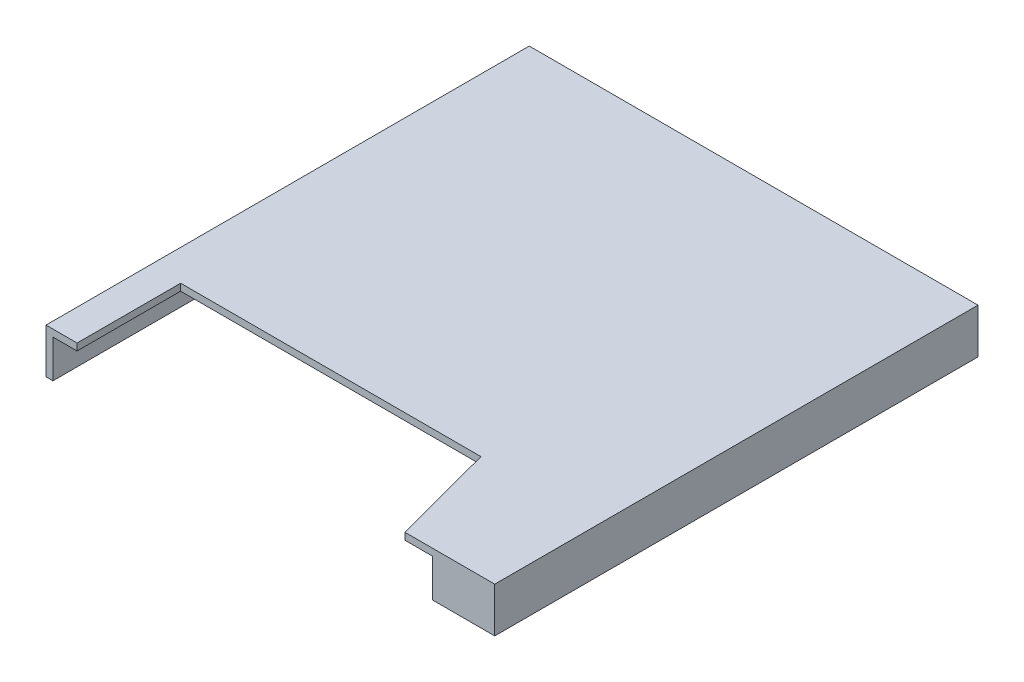
ISO-10303-21;
HEADER;
FILE_DESCRIPTION(('STEP AP214'),'2;1');
FILE_NAME('part.step','',(''),(''),'','','');
FILE_SCHEMA(('AUTOMOTIVE_DESIGN { 1 0 10303 214 1 1 1 1 }'));
ENDSEC;
DATA;
#1=APPLICATION_CONTEXT('core data for automotive mechanical design processes');
#2=APPLICATION_PROTOCOL_DEFINITION('international standard','automotive_design',2000,#1);
#3=PRODUCT_CONTEXT('',#1,'mechanical');
#4=PRODUCT('Part','Part','',(#3));
#5=PRODUCT_RELATED_PRODUCT_CATEGORY('part','',(#4));
#6=PRODUCT_DEFINITION_FORMATION('','',#4);
#7=PRODUCT_DEFINITION_CONTEXT('part definition',#1,'design');
#8=PRODUCT_DEFINITION('design','',#6,#7);
#9=PRODUCT_DEFINITION_SHAPE('','',#8);
#10=(LENGTH_UNIT() NAMED_UNIT(*) SI_UNIT(.MILLI.,.METRE.));
#11=(NAMED_UNIT(*) PLANE_ANGLE_UNIT() SI_UNIT($,.RADIAN.));
#12=(NAMED_UNIT(*) SI_UNIT($,.STERADIAN.) SOLID_ANGLE_UNIT());
#13=UNCERTAINTY_MEASURE_WITH_UNIT(LENGTH_MEASURE(1.E-05),#10,'distance_accuracy_value','');
#14=(GEOMETRIC_REPRESENTATION_CONTEXT(3) GLOBAL_UNCERTAINTY_ASSIGNED_CONTEXT((#13)) GLOBAL_UNIT_ASSIGNED_CONTEXT((#10,
#11,#12)) REPRESENTATION_CONTEXT('',''));
#15=CARTESIAN_POINT('',(0.,0.,0.));
#16=DIRECTION('',(0.,0.,1.));
#17=DIRECTION('',(1.,0.,0.));
#18=AXIS2_PLACEMENT_3D('',#15,#16,#17);
#19=CARTESIAN_POINT('',(-6.3,0.,-7.));
#20=DIRECTION('',(-1.,0.,0.));
#21=DIRECTION('',(0.,0.,1.));
#22=AXIS2_PLACEMENT_3D('',#19,#20,#21);
#23=PLANE('',#22);
#24=DIRECTION('',(0.,0.,1.));
#25=VECTOR('',#24,1.);
#26=CARTESIAN_POINT('',(-6.3,1.1,0.));
#27=LINE('',#26,#25);
#28=CARTESIAN_POINT('',(-6.3,1.1,-6.8));
#29=VERTEX_POINT('',#28);
#30=CARTESIAN_POINT('',(-6.3,1.1,7.));
#31=VERTEX_POINT('',#30);
#32=EDGE_CURVE('E144',#29,#31,#27,.T.);
#33=ORIENTED_EDGE('',*,*,#32,.T.);
#34=DIRECTION('',(0.,1.,0.));
#35=VECTOR('',#34,1.);
#36=CARTESIAN_POINT('',(-6.3,0.,7.));
#37=LINE('',#36,#35);
#38=CARTESIAN_POINT('',(-6.3,0.,7.));
#39=VERTEX_POINT('',#38);
#40=EDGE_CURVE('E20',#39,#31,#37,.T.);
#41=ORIENTED_EDGE('',*,*,#40,.F.);
#42=DIRECTION('',(0.,0.,1.));
#43=VECTOR('',#42,1.);
#44=CARTESIAN_POINT('',(-6.3,0.,0.));
#45=LINE('',#44,#43);
#46=CARTESIAN_POINT('',(-6.3,0.,-6.8));
#47=VERTEX_POINT('',#46);
#48=EDGE_CURVE('E180',#39,#47,#45,.F.);
#49=ORIENTED_EDGE('',*,*,#48,.T.);
#50=DIRECTION('',(0.,1.,0.));
#51=VECTOR('',#50,1.);
#52=CARTESIAN_POINT('',(-6.3,0.,-6.8));
#53=LINE('',#52,#51);
#54=EDGE_CURVE('E148',#47,#29,#53,.T.);
#55=ORIENTED_EDGE('',*,*,#54,.T.);
#56=EDGE_LOOP('',(#33,#41,#49,#55));
#57=FACE_BOUND('',#56,.T.);
#58=ADVANCED_FACE('F17',(#57),#23,.F.);
#59=CARTESIAN_POINT('',(6.5,0.,-6.8));
#60=DIRECTION('',(0.,0.,-1.));
#61=DIRECTION('',(-1.,0.,0.));
#62=AXIS2_PLACEMENT_3D('',#59,#60,#61);
#63=PLANE('',#62);
#64=DIRECTION('',(1.,0.,0.));
#65=VECTOR('',#64,1.);
#66=CARTESIAN_POINT('',(0.,1.1,-6.8));
#67=LINE('',#66,#65);
#68=CARTESIAN_POINT('',(6.3,1.1,-6.8));
#69=VERTEX_POINT('',#68);
#70=EDGE_CURVE('E142',#69,#29,#67,.F.);
#71=ORIENTED_EDGE('',*,*,#70,.T.);
#72=ORIENTED_EDGE('',*,*,#54,.F.);
#73=DIRECTION('',(1.,0.,0.));
#74=VECTOR('',#73,1.);
#75=CARTESIAN_POINT('',(0.,0.,-6.8));
#76=LINE('',#75,#74);
#77=CARTESIAN_POINT('',(6.3,0.,-6.8));
#78=VERTEX_POINT('',#77);
#79=EDGE_CURVE('E178',#47,#78,#76,.T.);
#80=ORIENTED_EDGE('',*,*,#79,.T.);
#81=DIRECTION('',(0.,1.,0.));
#82=VECTOR('',#81,1.);
#83=CARTESIAN_POINT('',(6.3,0.,-6.8));
#84=LINE('',#83,#82);
#85=EDGE_CURVE('E115',#78,#69,#84,.T.);
#86=ORIENTED_EDGE('',*,*,#85,.T.);
#87=EDGE_LOOP('',(#71,#72,#80,#86));
#88=FACE_BOUND('',#87,.T.);
#89=ADVANCED_FACE('F423',(#88),#63,.F.);
#90=CARTESIAN_POINT('',(6.3,0.,7.));
#91=DIRECTION('',(1.,0.,0.));
#92=DIRECTION('',(0.,0.,-1.));
#93=AXIS2_PLACEMENT_3D('',#90,#91,#92);
#94=PLANE('',#93);
#95=ORIENTED_EDGE('',*,*,#85,.F.);
#96=DIRECTION('',(0.,0.,1.));
#97=VECTOR('',#96,1.);
#98=CARTESIAN_POINT('',(6.3,0.,0.));
#99=LINE('',#98,#97);
#100=CARTESIAN_POINT('',(6.3,0.,6.8));
#101=VERTEX_POINT('',#100);
#102=EDGE_CURVE('E127',#78,#101,#99,.T.);
#103=ORIENTED_EDGE('',*,*,#102,.T.);
#104=DIRECTION('',(0.,1.,0.));
#105=VECTOR('',#104,1.);
#106=CARTESIAN_POINT('',(6.3,1.1,6.8));
#107=LINE('',#106,#105);
#108=CARTESIAN_POINT('',(6.3,1.1,6.8));
#109=VERTEX_POINT('',#108);
#110=EDGE_CURVE('E120',#109,#101,#107,.F.);
#111=ORIENTED_EDGE('',*,*,#110,.F.);
#112=DIRECTION('',(0.,0.,1.));
#113=VECTOR('',#112,1.);
#114=CARTESIAN_POINT('',(6.3,1.1,0.));
#115=LINE('',#114,#113);
#116=EDGE_CURVE('E124',#109,#69,#115,.F.);
#117=ORIENTED_EDGE('',*,*,#116,.T.);
#118=EDGE_LOOP('',(#95,#103,#111,#117));
#119=FACE_BOUND('',#118,.T.);
#120=ADVANCED_FACE('F122',(#119),#94,.F.);
#121=CARTESIAN_POINT('',(4.7,1.1,6.8));
#122=DIRECTION('',(0.,0.,-1.));
#123=DIRECTION('',(-1.,0.,0.));
#124=AXIS2_PLACEMENT_3D('',#121,#122,#123);
#125=PLANE('',#124);
#126=DIRECTION('',(1.,0.,0.));
#127=VECTOR('',#126,1.);
#128=CARTESIAN_POINT('',(0.,0.,6.8));
#129=LINE('',#128,#127);
#130=CARTESIAN_POINT('',(4.7,0.,6.8));
#131=VERTEX_POINT('',#130);
#132=EDGE_CURVE('E175',#101,#131,#129,.F.);
#133=ORIENTED_EDGE('',*,*,#132,.T.);
#134=DIRECTION('',(0.,1.,0.));
#135=VECTOR('',#134,1.);
#136=CARTESIAN_POINT('',(4.7,1.1,6.8));
#137=LINE('',#136,#135);
#138=CARTESIAN_POINT('',(4.7,1.1,6.8));
#139=VERTEX_POINT('',#138);
#140=EDGE_CURVE('E135',#139,#131,#137,.F.);
#141=ORIENTED_EDGE('',*,*,#140,.F.);
#142=DIRECTION('',(1.,0.,0.));
#143=VECTOR('',#142,1.);
#144=CARTESIAN_POINT('',(0.,1.1,6.8));
#145=LINE('',#144,#143);
#146=EDGE_CURVE('E130',#139,#109,#145,.T.);
#147=ORIENTED_EDGE('',*,*,#146,.T.);
#148=ORIENTED_EDGE('',*,*,#110,.T.);
#149=EDGE_LOOP('',(#133,#141,#147,#148));
#150=FACE_BOUND('',#149,.T.);
#151=ADVANCED_FACE('F133',(#150),#125,.T.);
#152=CARTESIAN_POINT('',(0.,1.1,0.));
#153=DIRECTION('',(0.,1.,0.));
#154=DIRECTION('',(0.,0.,1.));
#155=AXIS2_PLACEMENT_3D('',#152,#153,#154);
#156=PLANE('',#155);
#157=DIRECTION('',(1.,0.,0.));
#158=VECTOR('',#157,1.);
#159=CARTESIAN_POINT('',(0.,1.1,7.));
#160=LINE('',#159,#158);
#161=CARTESIAN_POINT('',(3.9,1.1,7.));
#162=VERTEX_POINT('',#161);
#163=CARTESIAN_POINT('',(4.7,1.1,7.));
#164=VERTEX_POINT('',#163);
#165=EDGE_CURVE('E163',#162,#164,#160,.T.);
#166=ORIENTED_EDGE('',*,*,#165,.F.);
#167=DIRECTION('',(-0.257662650560333,0.,-0.966234939601246));
#168=VECTOR('',#167,1.);
#169=CARTESIAN_POINT('',(3.1,1.1,4.));
#170=LINE('',#169,#168);
#171=CARTESIAN_POINT('',(3.1,1.1,4.));
#172=VERTEX_POINT('',#171);
#173=EDGE_CURVE('E207',#162,#172,#170,.T.);
#174=ORIENTED_EDGE('',*,*,#173,.T.);
#175=DIRECTION('',(-1.,0.,0.));
#176=VECTOR('',#175,1.);
#177=CARTESIAN_POINT('',(-5.6,1.1,4.));
#178=LINE('',#177,#176);
#179=CARTESIAN_POINT('',(-5.6,1.1,4.));
#180=VERTEX_POINT('',#179);
#181=EDGE_CURVE('E211',#172,#180,#178,.T.);
#182=ORIENTED_EDGE('',*,*,#181,.T.);
#183=DIRECTION('',(0.,0.,1.));
#184=VECTOR('',#183,1.);
#185=CARTESIAN_POINT('',(-5.6,1.1,7.));
#186=LINE('',#185,#184);
#187=CARTESIAN_POINT('',(-5.6,1.1,7.));
#188=VERTEX_POINT('',#187);
#189=EDGE_CURVE('E165',#180,#188,#186,.T.);
#190=ORIENTED_EDGE('',*,*,#189,.T.);
#191=DIRECTION('',(1.,0.,0.));
#192=VECTOR('',#191,1.);
#193=CARTESIAN_POINT('',(-6.5,1.1,7.));
#194=LINE('',#193,#192);
#195=EDGE_CURVE('E158',#31,#188,#194,.T.);
#196=ORIENTED_EDGE('',*,*,#195,.F.);
#197=ORIENTED_EDGE('',*,*,#32,.F.);
#198=ORIENTED_EDGE('',*,*,#70,.F.);
#199=ORIENTED_EDGE('',*,*,#116,.F.);
#200=ORIENTED_EDGE('',*,*,#146,.F.);
#201=DIRECTION('',(0.,0.,1.));
#202=VECTOR('',#201,1.);
#203=CARTESIAN_POINT('',(4.7,1.1,7.));
#204=LINE('',#203,#202);
#205=EDGE_CURVE('E183',#164,#139,#204,.F.);
#206=ORIENTED_EDGE('',*,*,#205,.F.);
#207=EDGE_LOOP('',(#166,#174,#182,#190,#196,#197,#198,#199,#200,#206));
#208=FACE_BOUND('',#207,.T.);
#209=ADVANCED_FACE('F140',(#208),#156,.F.);
#210=CARTESIAN_POINT('',(4.7,1.1,7.));
#211=DIRECTION('',(-1.,0.,0.));
#212=DIRECTION('',(0.,0.,1.));
#213=AXIS2_PLACEMENT_3D('',#210,#211,#212);
#214=PLANE('',#213);
#215=DIRECTION('',(0.,0.,1.));
#216=VECTOR('',#215,1.);
#217=CARTESIAN_POINT('',(4.7,0.,0.));
#218=LINE('',#217,#216);
#219=CARTESIAN_POINT('',(4.7,0.,7.));
#220=VERTEX_POINT('',#219);
#221=EDGE_CURVE('E170',#131,#220,#218,.T.);
#222=ORIENTED_EDGE('',*,*,#221,.T.);
#223=DIRECTION('',(0.,1.,0.));
#224=VECTOR('',#223,1.);
#225=CARTESIAN_POINT('',(4.7,0.,7.));
#226=LINE('',#225,#224);
#227=EDGE_CURVE('E190',#164,#220,#226,.F.);
#228=ORIENTED_EDGE('',*,*,#227,.F.);
#229=ORIENTED_EDGE('',*,*,#205,.T.);
#230=ORIENTED_EDGE('',*,*,#140,.T.);
#231=EDGE_LOOP('',(#222,#228,#229,#230));
#232=FACE_BOUND('',#231,.T.);
#233=ADVANCED_FACE('F195',(#232),#214,.T.);
#234=CARTESIAN_POINT('',(0.,0.,0.));
#235=DIRECTION('',(0.,1.,0.));
#236=DIRECTION('',(0.,0.,1.));
#237=AXIS2_PLACEMENT_3D('',#234,#235,#236);
#238=PLANE('',#237);
#239=DIRECTION('',(0.,0.,1.));
#240=VECTOR('',#239,1.);
#241=CARTESIAN_POINT('',(-6.5,0.,-7.));
#242=LINE('',#241,#240);
#243=CARTESIAN_POINT('',(-6.5,0.,-7.));
#244=VERTEX_POINT('',#243);
#245=CARTESIAN_POINT('',(-6.5,0.,7.));
#246=VERTEX_POINT('',#245);
#247=EDGE_CURVE('E167',#244,#246,#242,.T.);
#248=ORIENTED_EDGE('',*,*,#247,.F.);
#249=DIRECTION('',(-1.,0.,0.));
#250=VECTOR('',#249,1.);
#251=CARTESIAN_POINT('',(6.5,0.,-7.));
#252=LINE('',#251,#250);
#253=CARTESIAN_POINT('',(6.5,0.,-7.));
#254=VERTEX_POINT('',#253);
#255=EDGE_CURVE('E240',#254,#244,#252,.T.);
#256=ORIENTED_EDGE('',*,*,#255,.F.);
#257=DIRECTION('',(0.,0.,-1.));
#258=VECTOR('',#257,1.);
#259=CARTESIAN_POINT('',(6.5,0.,7.));
#260=LINE('',#259,#258);
#261=CARTESIAN_POINT('',(6.5,0.,7.));
#262=VERTEX_POINT('',#261);
#263=EDGE_CURVE('E244',#262,#254,#260,.T.);
#264=ORIENTED_EDGE('',*,*,#263,.F.);
#265=DIRECTION('',(1.,0.,0.));
#266=VECTOR('',#265,1.);
#267=CARTESIAN_POINT('',(-6.5,0.,7.));
#268=LINE('',#267,#266);
#269=EDGE_CURVE('E198',#220,#262,#268,.T.);
#270=ORIENTED_EDGE('',*,*,#269,.F.);
#271=ORIENTED_EDGE('',*,*,#221,.F.);
#272=ORIENTED_EDGE('',*,*,#132,.F.);
#273=ORIENTED_EDGE('',*,*,#102,.F.);
#274=ORIENTED_EDGE('',*,*,#79,.F.);
#275=ORIENTED_EDGE('',*,*,#48,.F.);
#276=DIRECTION('',(1.,0.,0.));
#277=VECTOR('',#276,1.);
#278=CARTESIAN_POINT('',(-6.5,0.,7.));
#279=LINE('',#278,#277);
#280=EDGE_CURVE('E161',#246,#39,#279,.T.);
#281=ORIENTED_EDGE('',*,*,#280,.F.);
#282=EDGE_LOOP('',(#248,#256,#264,#270,#271,#272,#273,#274,#275,#281));
#283=FACE_BOUND('',#282,.T.);
#284=ADVANCED_FACE('F253',(#283),#238,.F.);
#285=CARTESIAN_POINT('',(-6.5,0.,-7.));
#286=DIRECTION('',(-1.,0.,0.));
#287=DIRECTION('',(0.,0.,1.));
#288=AXIS2_PLACEMENT_3D('',#285,#286,#287);
#289=PLANE('',#288);
#290=ORIENTED_EDGE('',*,*,#247,.T.);
#291=DIRECTION('',(0.,1.,0.));
#292=VECTOR('',#291,1.);
#293=CARTESIAN_POINT('',(-6.5,0.,7.));
#294=LINE('',#293,#292);
#295=CARTESIAN_POINT('',(-6.5,1.3,7.));
#296=VERTEX_POINT('',#295);
#297=EDGE_CURVE('E166',#296,#246,#294,.F.);
#298=ORIENTED_EDGE('',*,*,#297,.F.);
#299=DIRECTION('',(0.,0.,1.));
#300=VECTOR('',#299,1.);
#301=CARTESIAN_POINT('',(-6.5,1.3,0.));
#302=LINE('',#301,#300);
#303=CARTESIAN_POINT('',(-6.5,1.3,-7.));
#304=VERTEX_POINT('',#303);
#305=EDGE_CURVE('E232',#304,#296,#302,.T.);
#306=ORIENTED_EDGE('',*,*,#305,.F.);
#307=DIRECTION('',(0.,1.,0.));
#308=VECTOR('',#307,1.);
#309=CARTESIAN_POINT('',(-6.5,0.,-7.));
#310=LINE('',#309,#308);
#311=EDGE_CURVE('E234',#244,#304,#310,.T.);
#312=ORIENTED_EDGE('',*,*,#311,.F.);
#313=EDGE_LOOP('',(#290,#298,#306,#312));
#314=FACE_BOUND('',#313,.T.);
#315=ADVANCED_FACE('F361',(#314),#289,.T.);
#316=CARTESIAN_POINT('',(-6.5,0.,7.));
#317=DIRECTION('',(0.,0.,1.));
#318=DIRECTION('',(1.,0.,0.));
#319=AXIS2_PLACEMENT_3D('',#316,#317,#318);
#320=PLANE('',#319);
#321=ORIENTED_EDGE('',*,*,#297,.T.);
#322=ORIENTED_EDGE('',*,*,#280,.T.);
#323=ORIENTED_EDGE('',*,*,#40,.T.);
#324=ORIENTED_EDGE('',*,*,#195,.T.);
#325=DIRECTION('',(0.,1.,0.));
#326=VECTOR('',#325,1.);
#327=CARTESIAN_POINT('',(-5.6,1.3,7.));
#328=LINE('',#327,#326);
#329=CARTESIAN_POINT('',(-5.6,1.3,7.));
#330=VERTEX_POINT('',#329);
#331=EDGE_CURVE('E213',#188,#330,#328,.T.);
#332=ORIENTED_EDGE('',*,*,#331,.T.);
#333=DIRECTION('',(1.,0.,0.));
#334=VECTOR('',#333,1.);
#335=CARTESIAN_POINT('',(0.,1.3,7.));
#336=LINE('',#335,#334);
#337=EDGE_CURVE('E218',#296,#330,#336,.T.);
#338=ORIENTED_EDGE('',*,*,#337,.F.);
#339=EDGE_LOOP('',(#321,#322,#323,#324,#332,#338));
#340=FACE_BOUND('',#339,.T.);
#341=ADVANCED_FACE('F156',(#340),#320,.T.);
#342=CARTESIAN_POINT('',(-5.6,1.3,7.));
#343=DIRECTION('',(-1.,0.,0.));
#344=DIRECTION('',(0.,0.,1.));
#345=AXIS2_PLACEMENT_3D('',#342,#343,#344);
#346=PLANE('',#345);
#347=DIRECTION('',(0.,0.,1.));
#348=VECTOR('',#347,1.);
#349=CARTESIAN_POINT('',(-5.6,1.3,0.));
#350=LINE('',#349,#348);
#351=CARTESIAN_POINT('',(-5.6,1.3,4.));
#352=VERTEX_POINT('',#351);
#353=EDGE_CURVE('E222',#330,#352,#350,.F.);
#354=ORIENTED_EDGE('',*,*,#353,.F.);
#355=ORIENTED_EDGE('',*,*,#331,.F.);
#356=ORIENTED_EDGE('',*,*,#189,.F.);
#357=DIRECTION('',(0.,1.,0.));
#358=VECTOR('',#357,1.);
#359=CARTESIAN_POINT('',(-5.6,1.3,4.));
#360=LINE('',#359,#358);
#361=EDGE_CURVE('E209',#180,#352,#360,.T.);
#362=ORIENTED_EDGE('',*,*,#361,.T.);
#363=EDGE_LOOP('',(#354,#355,#356,#362));
#364=FACE_BOUND('',#363,.T.);
#365=ADVANCED_FACE('F223',(#364),#346,.F.);
#366=CARTESIAN_POINT('',(-5.6,1.3,4.));
#367=DIRECTION('',(0.,0.,-1.));
#368=DIRECTION('',(-1.,0.,0.));
#369=AXIS2_PLACEMENT_3D('',#366,#367,#368);
#370=PLANE('',#369);
#371=DIRECTION('',(1.,0.,0.));
#372=VECTOR('',#371,1.);
#373=CARTESIAN_POINT('',(0.,1.3,4.));
#374=LINE('',#373,#372);
#375=CARTESIAN_POINT('',(3.1,1.3,4.));
#376=VERTEX_POINT('',#375);
#377=EDGE_CURVE('E228',#352,#376,#374,.T.);
#378=ORIENTED_EDGE('',*,*,#377,.F.);
#379=ORIENTED_EDGE('',*,*,#361,.F.);
#380=ORIENTED_EDGE('',*,*,#181,.F.);
#381=DIRECTION('',(0.,1.,0.));
#382=VECTOR('',#381,1.);
#383=CARTESIAN_POINT('',(3.1,1.3,4.));
#384=LINE('',#383,#382);
#385=EDGE_CURVE('E202',#172,#376,#384,.T.);
#386=ORIENTED_EDGE('',*,*,#385,.T.);
#387=EDGE_LOOP('',(#378,#379,#380,#386));
#388=FACE_BOUND('',#387,.T.);
#389=ADVANCED_FACE('F263',(#388),#370,.F.);
#390=CARTESIAN_POINT('',(3.1,1.3,4.));
#391=DIRECTION('',(0.966234939601246,0.,-0.257662650560333));
#392=DIRECTION('',(-0.257662650560333,0.,-0.966234939601246));
#393=AXIS2_PLACEMENT_3D('',#390,#391,#392);
#394=PLANE('',#393);
#395=DIRECTION('',(0.257662650560332,0.,0.966234939601246));
#396=VECTOR('',#395,1.);
#397=CARTESIAN_POINT('',(3.1,1.3,4.));
#398=LINE('',#397,#396);
#399=CARTESIAN_POINT('',(3.9,1.3,7.));
#400=VERTEX_POINT('',#399);
#401=EDGE_CURVE('E258',#376,#400,#398,.T.);
#402=ORIENTED_EDGE('',*,*,#401,.F.);
#403=ORIENTED_EDGE('',*,*,#385,.F.);
#404=ORIENTED_EDGE('',*,*,#173,.F.);
#405=DIRECTION('',(0.,1.,0.));
#406=VECTOR('',#405,1.);
#407=CARTESIAN_POINT('',(3.9,0.,7.));
#408=LINE('',#407,#406);
#409=EDGE_CURVE('E192',#400,#162,#408,.F.);
#410=ORIENTED_EDGE('',*,*,#409,.F.);
#411=EDGE_LOOP('',(#402,#403,#404,#410));
#412=FACE_BOUND('',#411,.T.);
#413=ADVANCED_FACE('F267',(#412),#394,.F.);
#414=CARTESIAN_POINT('',(-6.5,0.,7.));
#415=DIRECTION('',(0.,0.,1.));
#416=DIRECTION('',(1.,0.,0.));
#417=AXIS2_PLACEMENT_3D('',#414,#415,#416);
#418=PLANE('',#417);
#419=ORIENTED_EDGE('',*,*,#227,.T.);
#420=ORIENTED_EDGE('',*,*,#269,.T.);
#421=DIRECTION('',(0.,1.,0.));
#422=VECTOR('',#421,1.);
#423=CARTESIAN_POINT('',(6.5,0.,7.));
#424=LINE('',#423,#422);
#425=CARTESIAN_POINT('',(6.5,1.3,7.));
#426=VERTEX_POINT('',#425);
#427=EDGE_CURVE('E200',#426,#262,#424,.F.);
#428=ORIENTED_EDGE('',*,*,#427,.F.);
#429=DIRECTION('',(1.,0.,0.));
#430=VECTOR('',#429,1.);
#431=CARTESIAN_POINT('',(0.,1.3,7.));
#432=LINE('',#431,#430);
#433=EDGE_CURVE('E250',#400,#426,#432,.T.);
#434=ORIENTED_EDGE('',*,*,#433,.F.);
#435=ORIENTED_EDGE('',*,*,#409,.T.);
#436=ORIENTED_EDGE('',*,*,#165,.T.);
#437=EDGE_LOOP('',(#419,#420,#428,#434,#435,#436));
#438=FACE_BOUND('',#437,.T.);
#439=ADVANCED_FACE('F188',(#438),#418,.T.);
#440=CARTESIAN_POINT('',(6.5,0.,7.));
#441=DIRECTION('',(1.,0.,0.));
#442=DIRECTION('',(0.,0.,-1.));
#443=AXIS2_PLACEMENT_3D('',#440,#441,#442);
#444=PLANE('',#443);
#445=ORIENTED_EDGE('',*,*,#263,.T.);
#446=DIRECTION('',(0.,1.,0.));
#447=VECTOR('',#446,1.);
#448=CARTESIAN_POINT('',(6.5,0.,-7.));
#449=LINE('',#448,#447);
#450=CARTESIAN_POINT('',(6.5,1.3,-7.));
#451=VERTEX_POINT('',#450);
#452=EDGE_CURVE('E35',#451,#254,#449,.F.);
#453=ORIENTED_EDGE('',*,*,#452,.F.);
#454=DIRECTION('',(0.,0.,1.));
#455=VECTOR('',#454,1.);
#456=CARTESIAN_POINT('',(6.5,1.3,0.));
#457=LINE('',#456,#455);
#458=EDGE_CURVE('E26',#426,#451,#457,.F.);
#459=ORIENTED_EDGE('',*,*,#458,.F.);
#460=ORIENTED_EDGE('',*,*,#427,.T.);
#461=EDGE_LOOP('',(#445,#453,#459,#460));
#462=FACE_BOUND('',#461,.T.);
#463=ADVANCED_FACE('F246',(#462),#444,.T.);
#464=CARTESIAN_POINT('',(6.5,0.,-7.));
#465=DIRECTION('',(0.,0.,-1.));
#466=DIRECTION('',(-1.,0.,0.));
#467=AXIS2_PLACEMENT_3D('',#464,#465,#466);
#468=PLANE('',#467);
#469=ORIENTED_EDGE('',*,*,#255,.T.);
#470=ORIENTED_EDGE('',*,*,#311,.T.);
#471=DIRECTION('',(1.,0.,0.));
#472=VECTOR('',#471,1.);
#473=CARTESIAN_POINT('',(0.,1.3,-7.));
#474=LINE('',#473,#472);
#475=EDGE_CURVE('E11',#451,#304,#474,.F.);
#476=ORIENTED_EDGE('',*,*,#475,.F.);
#477=ORIENTED_EDGE('',*,*,#452,.T.);
#478=EDGE_LOOP('',(#469,#470,#476,#477));
#479=FACE_BOUND('',#478,.T.);
#480=ADVANCED_FACE('F256',(#479),#468,.T.);
#481=CARTESIAN_POINT('',(0.,1.3,0.));
#482=DIRECTION('',(0.,1.,0.));
#483=DIRECTION('',(0.,0.,1.));
#484=AXIS2_PLACEMENT_3D('',#481,#482,#483);
#485=PLANE('',#484);
#486=ORIENTED_EDGE('',*,*,#458,.T.);
#487=ORIENTED_EDGE('',*,*,#475,.T.);
#488=ORIENTED_EDGE('',*,*,#305,.T.);
#489=ORIENTED_EDGE('',*,*,#337,.T.);
#490=ORIENTED_EDGE('',*,*,#353,.T.);
#491=ORIENTED_EDGE('',*,*,#377,.T.);
#492=ORIENTED_EDGE('',*,*,#401,.T.);
#493=ORIENTED_EDGE('',*,*,#433,.T.);
#494=EDGE_LOOP('',(#486,#487,#488,#489,#490,#491,#492,#493));
#495=FACE_BOUND('',#494,.T.);
#496=ADVANCED_FACE('F231',(#495),#485,.T.);
#497=CLOSED_SHELL('',(#58,#89,#120,#151,#209,#233,#284,#315,#341,#365,#389,#413,#439,#463,#480,#496));
#498=MANIFOLD_SOLID_BREP('B1',#497);
#499=ADVANCED_BREP_SHAPE_REPRESENTATION('',(#18,#498),#14);
#500=SHAPE_DEFINITION_REPRESENTATION(#9,#499);
ENDSEC;
END-ISO-10303-21;
